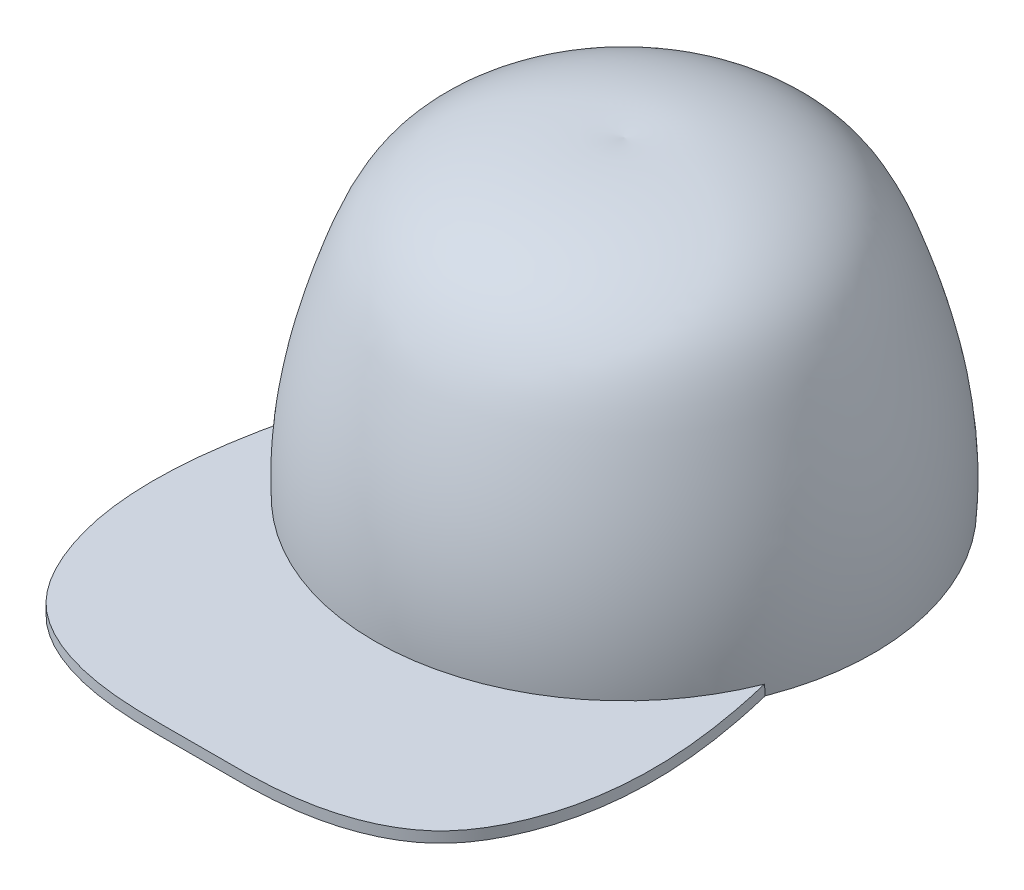
ISO-10303-21;
HEADER;
FILE_DESCRIPTION(('STEP AP214'),'2;1');
FILE_NAME('part.step','',(''),(''),'','','');
FILE_SCHEMA(('AUTOMOTIVE_DESIGN { 1 0 10303 214 1 1 1 1 }'));
ENDSEC;
DATA;
#1=APPLICATION_CONTEXT('core data for automotive mechanical design processes');
#2=APPLICATION_PROTOCOL_DEFINITION('international standard','automotive_design',2000,#1);
#3=PRODUCT_CONTEXT('',#1,'mechanical');
#4=PRODUCT('Part','Part','',(#3));
#5=PRODUCT_RELATED_PRODUCT_CATEGORY('part','',(#4));
#6=PRODUCT_DEFINITION_FORMATION('','',#4);
#7=PRODUCT_DEFINITION_CONTEXT('part definition',#1,'design');
#8=PRODUCT_DEFINITION('design','',#6,#7);
#9=PRODUCT_DEFINITION_SHAPE('','',#8);
#10=(LENGTH_UNIT() NAMED_UNIT(*) SI_UNIT(.MILLI.,.METRE.));
#11=(NAMED_UNIT(*) PLANE_ANGLE_UNIT() SI_UNIT($,.RADIAN.));
#12=(NAMED_UNIT(*) SI_UNIT($,.STERADIAN.) SOLID_ANGLE_UNIT());
#13=UNCERTAINTY_MEASURE_WITH_UNIT(LENGTH_MEASURE(1.E-05),#10,'distance_accuracy_value','');
#14=(GEOMETRIC_REPRESENTATION_CONTEXT(3) GLOBAL_UNCERTAINTY_ASSIGNED_CONTEXT((#13)) GLOBAL_UNIT_ASSIGNED_CONTEXT((#10,
#11,#12)) REPRESENTATION_CONTEXT('',''));
#15=CARTESIAN_POINT('',(0.,0.,0.));
#16=DIRECTION('',(0.,0.,1.));
#17=DIRECTION('',(1.,0.,0.));
#18=AXIS2_PLACEMENT_3D('',#15,#16,#17);
#19=CARTESIAN_POINT('',(-90.,4.18,-130.85));
#20=CARTESIAN_POINT('',(-97.0793096691178,4.18,-101.675750548852));
#21=CARTESIAN_POINT('',(-102.319849387112,4.18,-59.8491014325423));
#22=CARTESIAN_POINT('',(-75.2208808817832,4.18,-11.0048044321176));
#23=CARTESIAN_POINT('',(-38.5303195168428,4.18,1.06979931387679));
#24=CARTESIAN_POINT('',(0.,4.18,-0.48833617963581));
#25=CARTESIAN_POINT('',(38.5303195168428,4.18,1.06979931387678));
#26=CARTESIAN_POINT('',(75.2208808817831,4.18,-11.0048044321176));
#27=CARTESIAN_POINT('',(102.319849387112,4.18,-59.8491014325423));
#28=CARTESIAN_POINT('',(97.0793096691178,4.18,-101.675750548852));
#29=CARTESIAN_POINT('',(90.,4.18,-130.85));
#30=B_SPLINE_CURVE_WITH_KNOTS('',3,(#19,#20,#21,#22,#23,#24,#25,#26,#27,#28,#29),.UNSPECIFIED.,
.F.,.F.,(4,1,1,1,1,1,1,1,4),(0.,0.232377867082386,0.29749861003515,0.407563265498817,0.5,
0.592436734501183,0.70250138996485,0.767622132917614,1.),.UNSPECIFIED.);
#31=DIRECTION('',(0.,-1.,0.));
#32=VECTOR('',#31,1.);
#33=SURFACE_OF_LINEAR_EXTRUSION('',#30,#32);
#34=CARTESIAN_POINT('',(90.0955880969949,4.18,-130.455107886212));
#35=CARTESIAN_POINT('',(90.0835062443815,3.49609904977406,-130.505179936874));
#36=CARTESIAN_POINT('',(90.0694996433252,2.81300235778806,-130.563123638354));
#37=CARTESIAN_POINT('',(90.0376369443269,1.44841749029595,-130.69475434295));
#38=CARTESIAN_POINT('',(90.0197808463849,0.766929314789829,-130.768441346066));
#39=CARTESIAN_POINT('',(90.,0.086245397523655,-130.85));
#40=B_SPLINE_CURVE_WITH_KNOTS('',3,(#34,#35,#36,#37,#38,#39),.UNSPECIFIED.,.F.,.F.,(4,2,4),(0.,
2.05707868885687,4.11415737771374),.UNSPECIFIED.);
#41=CARTESIAN_POINT('',(90.0955880969949,4.18,-130.455107886212));
#42=VERTEX_POINT('',#41);
#43=CARTESIAN_POINT('',(90.,0.0862453975236535,-130.85));
#44=VERTEX_POINT('',#43);
#45=EDGE_CURVE('E87',#42,#44,#40,.T.);
#46=ORIENTED_EDGE('',*,*,#45,.F.);
#47=CARTESIAN_POINT('',(-90.0955880969949,4.18,-130.455107886212));
#48=VERTEX_POINT('',#47);
#49=EDGE_CURVE('E127',#48,#42,#30,.T.);
#50=ORIENTED_EDGE('',*,*,#49,.F.);
#51=CARTESIAN_POINT('',(-90.,0.0862453975234178,-130.85));
#52=CARTESIAN_POINT('',(-90.0197808463849,0.76692931478963,-130.768441346066));
#53=CARTESIAN_POINT('',(-90.0376369443269,1.44841749029578,-130.69475434295));
#54=CARTESIAN_POINT('',(-90.0694996433252,2.81300235778798,-130.563123638354));
#55=CARTESIAN_POINT('',(-90.0835062443815,3.49609904977402,-130.505179936875));
#56=CARTESIAN_POINT('',(-90.0955880969949,4.18000000000001,-130.455107886213));
#57=B_SPLINE_CURVE_WITH_KNOTS('',3,(#51,#52,#53,#54,#55,#56),.UNSPECIFIED.,.F.,.F.,(4,2,4),(0.,
2.05707868885699,4.11415737771398),.UNSPECIFIED.);
#58=CARTESIAN_POINT('',(-90.,0.0862453975234178,-130.85));
#59=VERTEX_POINT('',#58);
#60=EDGE_CURVE('E52',#59,#48,#57,.T.);
#61=ORIENTED_EDGE('',*,*,#60,.F.);
#62=DIRECTION('',(0.,-1.,0.));
#63=VECTOR('',#62,1.);
#64=CARTESIAN_POINT('',(-90.,4.18,-130.85));
#65=LINE('',#64,#63);
#66=CARTESIAN_POINT('',(-90.,0.,-130.85));
#67=VERTEX_POINT('',#66);
#68=EDGE_CURVE('E58',#59,#67,#65,.T.);
#69=ORIENTED_EDGE('',*,*,#68,.T.);
#70=CARTESIAN_POINT('',(-90.,0.,-130.85));
#71=CARTESIAN_POINT('',(-97.0793096691178,0.,-101.675750548852));
#72=CARTESIAN_POINT('',(-102.319849387112,0.,-59.8491014325423));
#73=CARTESIAN_POINT('',(-75.2208808817832,0.,-11.0048044321176));
#74=CARTESIAN_POINT('',(-38.5303195168428,0.,1.06979931387679));
#75=CARTESIAN_POINT('',(0.,0.,-0.48833617963581));
#76=CARTESIAN_POINT('',(38.5303195168428,0.,1.06979931387678));
#77=CARTESIAN_POINT('',(75.2208808817831,0.,-11.0048044321176));
#78=CARTESIAN_POINT('',(102.319849387112,0.,-59.8491014325423));
#79=CARTESIAN_POINT('',(97.0793096691178,0.,-101.675750548852));
#80=CARTESIAN_POINT('',(90.,0.,-130.85));
#81=B_SPLINE_CURVE_WITH_KNOTS('',3,(#70,#71,#72,#73,#74,#75,#76,#77,#78,#79,#80),.UNSPECIFIED.,
.F.,.F.,(4,1,1,1,1,1,1,1,4),(0.,0.232377867082386,0.29749861003515,0.407563265498817,0.5,
0.592436734501183,0.70250138996485,0.767622132917614,1.),.UNSPECIFIED.);
#82=CARTESIAN_POINT('',(90.,0.,-130.85));
#83=VERTEX_POINT('',#82);
#84=EDGE_CURVE('E126',#67,#83,#81,.T.);
#85=ORIENTED_EDGE('',*,*,#84,.T.);
#86=DIRECTION('',(0.,-1.,0.));
#87=VECTOR('',#86,1.);
#88=CARTESIAN_POINT('',(90.,4.18,-130.85));
#89=LINE('',#88,#87);
#90=EDGE_CURVE('E45',#44,#83,#89,.T.);
#91=ORIENTED_EDGE('',*,*,#90,.F.);
#92=EDGE_LOOP('',(#46,#50,#61,#69,#85,#91));
#93=FACE_BOUND('',#92,.T.);
#94=ADVANCED_FACE('F36',(#93),#33,.F.);
#95=CARTESIAN_POINT('',(0.,4.18,-166.176743665723));
#96=DIRECTION('',(0.,-1.,0.));
#97=DIRECTION('',(0.,0.,-1.));
#98=AXIS2_PLACEMENT_3D('',#95,#96,#97);
#99=CYLINDRICAL_SURFACE('',#98,96.6849461810042);
#100=CARTESIAN_POINT('',(90.,0.0862453975234855,-130.85));
#101=CARTESIAN_POINT('',(89.6040755077578,0.0867248526291828,-129.841304869187));
#102=CARTESIAN_POINT('',(89.1911801550303,0.0872011736557143,-128.839271862934));
#103=CARTESIAN_POINT('',(88.332030943499,0.0881469168562876,-126.849850907372));
#104=CARTESIAN_POINT('',(87.8857838544708,0.0886163404073642,-125.862460034484));
#105=CARTESIAN_POINT('',(86.9604000171116,0.0895478058748651,-123.903332949486));
#106=CARTESIAN_POINT('',(86.4812665664646,0.0900098485256991,-122.931595179789));
#107=CARTESIAN_POINT('',(85.4897916038072,0.0909268365689676,-121.003169998976));
#108=CARTESIAN_POINT('',(84.9773961997479,0.0913817688830027,-120.046510299457));
#109=CARTESIAN_POINT('',(83.9206338552704,0.0922832788044682,-118.150879430029));
#110=CARTESIAN_POINT('',(83.376263700706,0.0927298555660172,-117.211910050949));
#111=CARTESIAN_POINT('',(82.2561263445663,0.0936141721595742,-115.352666874058));
#112=CARTESIAN_POINT('',(81.6803527920402,0.0940519101793452,-114.432396910011));
#113=CARTESIAN_POINT('',(80.1029156928423,0.0952074936438153,-112.003125871933));
#114=CARTESIAN_POINT('',(79.0738415675734,0.0959169796929432,-110.511797445324));
#115=CARTESIAN_POINT('',(76.9332831170625,0.0973076399369353,-107.588933594227));
#116=CARTESIAN_POINT('',(75.8217743271395,0.0979888056326251,-106.157416118876));
#117=CARTESIAN_POINT('',(73.5199829215179,0.0993205287872147,-103.358964384178));
#118=CARTESIAN_POINT('',(72.3296942314176,0.0999710838792215,-101.992035118928));
#119=CARTESIAN_POINT('',(69.8734980200897,0.101239804070787,-99.3264668587988));
#120=CARTESIAN_POINT('',(68.6075481706398,0.101857950669662,-98.0278668688158));
#121=CARTESIAN_POINT('',(66.0047491294253,0.103059439964794,-95.5039914284799));
#122=CARTESIAN_POINT('',(64.667905092806,0.103642785185134,-94.2787106603958));
#123=CARTESIAN_POINT('',(61.927436113381,0.104772863193861,-91.9052351892482));
#124=CARTESIAN_POINT('',(60.523812695253,0.105319596817463,-90.7570387276714));
#125=CARTESIAN_POINT('',(58.0133376147478,0.106242674512008,-88.818620952221));
#126=CARTESIAN_POINT('',(56.9200905002619,0.10662742705689,-88.0107060394147));
#127=CARTESIAN_POINT('',(54.7004144168118,0.107374711902045,-86.4416155137621));
#128=CARTESIAN_POINT('',(53.5739833847523,0.107737242816429,-85.6804428160644));
#129=CARTESIAN_POINT('',(51.2901056905137,0.108439373258941,-84.2063153228853));
#130=CARTESIAN_POINT('',(50.1326608859021,0.108778974156191,-83.4933576485422));
#131=CARTESIAN_POINT('',(47.7886333351638,0.109434691219422,-82.1168077471285));
#132=CARTESIAN_POINT('',(46.602047917604,0.109750805221495,-81.453220068636));
#133=CARTESIAN_POINT('',(44.2021663913364,0.110358890733952,-80.1767775612289));
#134=CARTESIAN_POINT('',(42.9888750424769,0.11065086650312,-79.5639137829166));
#135=CARTESIAN_POINT('',(40.5374208304032,0.111210239086476,-78.3898224883094));
#136=CARTESIAN_POINT('',(39.2992556542789,0.111477633601948,-77.8285998012269));
#137=CARTESIAN_POINT('',(36.8004876132319,0.111987306877309,-76.7589055574824));
#138=CARTESIAN_POINT('',(35.5398869511645,0.11222958808721,-76.2504288550045));
#139=CARTESIAN_POINT('',(32.9982524648925,0.112688650075939,-75.2870229112953));
#140=CARTESIAN_POINT('',(31.7172167405175,0.112905428467486,-74.8320986830297));
#141=CARTESIAN_POINT('',(29.137166361052,0.113313058695054,-73.9766820251347));
#142=CARTESIAN_POINT('',(27.8381525615483,0.113503911760233,-73.5761870149357));
#143=CARTESIAN_POINT('',(25.2242738417792,0.113859376517775,-72.8302805062896));
#144=CARTESIAN_POINT('',(23.9094074499596,0.114023985753503,-72.484874164588));
#145=CARTESIAN_POINT('',(21.2664036085338,0.114326630885994,-71.8498338725596));
#146=CARTESIAN_POINT('',(19.9382673991071,0.114464669242047,-71.5601947606511));
#147=CARTESIAN_POINT('',(17.2708404498431,0.114713954641628,-71.0371396660831));
#148=CARTESIAN_POINT('',(15.9315486771033,0.114825199175114,-70.803728950893));
#149=CARTESIAN_POINT('',(13.2444582733986,0.115020669463056,-70.3936026059085));
#150=CARTESIAN_POINT('',(11.8966605631838,0.115104898092456,-70.2168809434473));
#151=CARTESIAN_POINT('',(9.19468484276579,0.115246207745375,-69.920398899976));
#152=CARTESIAN_POINT('',(7.84050623807647,0.115303286186796,-69.8006439367369));
#153=CARTESIAN_POINT('',(5.12844742037095,0.115390176189687,-69.6183428171281));
#154=CARTESIAN_POINT('',(3.77056761330166,0.115419990629604,-69.5557906214728));
#155=CARTESIAN_POINT('',(1.05322107472424,0.115452311121515,-69.4879806199305));
#156=CARTESIAN_POINT('',(-0.30624582205971,0.115454814016837,-69.4827294369041));
#157=CARTESIAN_POINT('',(-3.02420199338591,0.115432498660402,-69.5295481397571));
#158=CARTESIAN_POINT('',(-4.38269126083081,0.115407680212261,-69.5816184376583));
#159=CARTESIAN_POINT('',(-7.09610967243504,0.115330771002224,-69.742978824829));
#160=CARTESIAN_POINT('',(-8.45103920987423,0.11527868339236,-69.8522623008473));
#161=CARTESIAN_POINT('',(-11.155229715075,0.115147324613294,-70.1278654119702));
#162=CARTESIAN_POINT('',(-12.5044900688092,0.115068050572643,-70.2941910719101));
#163=CARTESIAN_POINT('',(-15.1946707108504,0.114882471735456,-70.6835617365451));
#164=CARTESIAN_POINT('',(-16.5355917799285,0.114776169509706,-70.9066013468938));
#165=CARTESIAN_POINT('',(-19.2069621977339,0.114536711047586,-71.4090342095321));
#166=CARTESIAN_POINT('',(-20.5374105715129,0.114403552341046,-71.6884326455217));
#167=CARTESIAN_POINT('',(-23.1852207240125,0.114110640526657,-72.3030447563562));
#168=CARTESIAN_POINT('',(-24.5025837164446,0.113950889910168,-72.6382532024358));
#169=CARTESIAN_POINT('',(-27.1221282826675,0.113605057221695,-73.3639411817397));
#170=CARTESIAN_POINT('',(-28.4243084437712,0.113418972720304,-73.7544258144141));
#171=CARTESIAN_POINT('',(-31.0109268619284,0.113020837027577,-74.5899093634848));
#172=CARTESIAN_POINT('',(-32.2953667672608,0.112808788266935,-75.0349031769025));
#173=CARTESIAN_POINT('',(-34.8443662164508,0.112359088278933,-75.9786505299517));
#174=CARTESIAN_POINT('',(-36.1089254344114,0.112121436632375,-76.477404949811));
#175=CARTESIAN_POINT('',(-38.6157762539423,0.111620984806611,-77.5277315911171));
#176=CARTESIAN_POINT('',(-39.8580699269985,0.111358186981462,-78.079298868493));
#177=CARTESIAN_POINT('',(-42.31842425577,0.110807869648786,-79.2343670623865));
#178=CARTESIAN_POINT('',(-43.5364825058121,0.110520347702002,-79.8378731031334));
#179=CARTESIAN_POINT('',(-45.9459611280108,0.109921149682167,-81.0956400320997));
#180=CARTESIAN_POINT('',(-47.1373839774009,0.10960947586751,-81.7498961747797));
#181=CARTESIAN_POINT('',(-49.4918911469352,0.108962428548319,-83.1082226799364));
#182=CARTESIAN_POINT('',(-50.6549681877401,0.108627049040521,-83.8123056606857));
#183=CARTESIAN_POINT('',(-52.9502935326755,0.107933296568485,-85.2688171507646));
#184=CARTESIAN_POINT('',(-54.0825446633264,0.107574925722575,-86.021241206155));
#185=CARTESIAN_POINT('',(-56.3143854653584,0.106835783207517,-87.573205153587));
#186=CARTESIAN_POINT('',(-57.4139733275696,0.106455010301021,-88.3727476481574));
#187=CARTESIAN_POINT('',(-59.578370406833,0.105671803270818,-90.0174103492867));
#188=CARTESIAN_POINT('',(-60.6431817863011,0.105269370498068,-90.8625277132847));
#189=CARTESIAN_POINT('',(-63.0856249619587,0.104305670178917,-92.8864402504351));
#190=CARTESIAN_POINT('',(-64.4490437480538,0.1037362204765,-94.0824586491836));
#191=CARTESIAN_POINT('',(-67.1064767145754,0.102561825751396,-96.5492579202441));
#192=CARTESIAN_POINT('',(-68.4004889425786,0.101956879731192,-97.8200408935953));
#193=CARTESIAN_POINT('',(-70.9151448463253,0.100713362051511,-100.432479050961));
#194=CARTESIAN_POINT('',(-72.1357817493194,0.100074787298183,-101.774140755874));
#195=CARTESIAN_POINT('',(-74.4987149593726,0.0987666397570553,-104.522852695413));
#196=CARTESIAN_POINT('',(-75.6410747076759,0.0980970928265556,-105.929848389203));
#197=CARTESIAN_POINT('',(-77.8448195605601,0.0967287293176806,-108.805632103311));
#198=CARTESIAN_POINT('',(-78.9062125914407,0.0960299156148004,-110.274414053119));
#199=CARTESIAN_POINT('',(-80.9444808949656,0.0946053901867256,-113.268820705891));
#200=CARTESIAN_POINT('',(-81.9213876927483,0.093879688640087,-114.794423899953));
#201=CARTESIAN_POINT('',(-83.3186033205311,0.0927747160585327,-117.117594797861));
#202=CARTESIAN_POINT('',(-83.7718122367504,0.0924047117059201,-117.89555763354));
#203=CARTESIAN_POINT('',(-84.6562448514406,0.0916589352623864,-119.463693779672));
#204=CARTESIAN_POINT('',(-85.0874732232904,0.0912831644197957,-120.253864447616));
#205=CARTESIAN_POINT('',(-85.927647583948,0.0905261266258107,-121.845848849833));
#206=CARTESIAN_POINT('',(-86.336595938751,0.0901448602634646,-122.647661336321));
#207=CARTESIAN_POINT('',(-87.1312227412247,0.0893777863545588,-124.260924700791));
#208=CARTESIAN_POINT('',(-87.5169421740661,0.0889919883327419,-125.072355387583));
#209=CARTESIAN_POINT('',(-88.2656539264687,0.0882154330413382,-126.705737559157));
#210=CARTESIAN_POINT('',(-88.6286438589825,0.0878246752560436,-127.527690138066));
#211=CARTESIAN_POINT('',(-89.3316486167027,0.0870384630881437,-129.181566916549));
#212=CARTESIAN_POINT('',(-89.6716585841459,0.0866430077331575,-130.013493180984));
#213=CARTESIAN_POINT('',(-90.,0.0862453975236916,-130.85));
#214=B_SPLINE_CURVE_WITH_KNOTS('',3,(#100,#101,#102,#103,#104,#105,#106,#107,#108,#109,#110,
#111,#112,#113,#114,#115,#116,#117,#118,#119,#120,#121,#122,#123,#124,#125,#126,#127,#128,#129,
#130,#131,#132,#133,#134,#135,#136,#137,#138,#139,#140,#141,#142,#143,#144,#145,#146,#147,#148,
#149,#150,#151,#152,#153,#154,#155,#156,#157,#158,#159,#160,#161,#162,#163,#164,#165,#166,#167,
#168,#169,#170,#171,#172,#173,#174,#175,#176,#177,#178,#179,#180,#181,#182,#183,#184,#185,#186,
#187,#188,#189,#190,#191,#192,#193,#194,#195,#196,#197,#198,#199,#200,#201,#202,#203,#204,#205,
#206,#207,#208,#209,#210,#211,#212,#213),.UNSPECIFIED.,.F.,.F.,(4,2,2,2,2,2,2,2,2,2,2,2,2,2,2,2,
2,2,2,2,2,2,2,2,2,2,2,2,2,2,2,2,2,2,2,2,2,2,2,2,2,2,2,2,2,2,2,2,2,2,2,2,2,2,2,2,4),(0.,
3.25069178492018,6.50072552322068,9.75043383876495,13.0055456091913,16.2609851498065,
19.5170855220162,24.9497767393864,30.3840867544279,35.8188162765442,41.2566152173733,
46.6940192837064,52.131299265132,56.2083064103158,60.2855675665029,64.3625850589426,
68.4399777129777,72.5166494377713,76.5937020055675,80.6703564476662,84.7473921962383,
88.8242345790389,92.9014583636034,96.9783045957771,101.05553259802,105.132326570702,
109.209508186031,113.286259295833,117.363481592224,121.44073319553,125.517513614776,
129.594724759093,133.671548244497,137.748746873858,141.825563730641,145.902756935551,
149.979568737716,154.056447300071,158.132944578252,162.209844501877,166.286363661336,
170.363918888605,174.441098964688,178.518504450222,182.595655916423,188.033643591787,
193.471784158911,198.910425913423,204.344606363623,209.778254145981,215.209865593041,
217.910620049018,220.610797869955,223.310688388113,226.005666525979,228.700927216847,
231.396755891591),.UNSPECIFIED.);
#215=EDGE_CURVE('E122',#44,#59,#214,.T.);
#216=ORIENTED_EDGE('',*,*,#215,.F.);
#217=ORIENTED_EDGE('',*,*,#90,.T.);
#218=CARTESIAN_POINT('',(0.,0.,-166.176743665723));
#219=DIRECTION('',(0.,-1.,0.));
#220=DIRECTION('',(0.,0.,-1.));
#221=AXIS2_PLACEMENT_3D('',#218,#219,#220);
#222=CIRCLE('',#221,96.6849461810042);
#223=EDGE_CURVE('E156',#83,#67,#222,.T.);
#224=ORIENTED_EDGE('',*,*,#223,.T.);
#225=ORIENTED_EDGE('',*,*,#68,.F.);
#226=EDGE_LOOP('',(#216,#217,#224,#225));
#227=FACE_BOUND('',#226,.T.);
#228=ADVANCED_FACE('F132',(#227),#99,.F.);
#229=CARTESIAN_POINT('',(0.,4.18,0.));
#230=DIRECTION('',(0.,1.,0.));
#231=DIRECTION('',(0.,0.,1.));
#232=AXIS2_PLACEMENT_3D('',#229,#230,#231);
#233=PLANE('',#232);
#234=ORIENTED_EDGE('',*,*,#49,.T.);
#235=CARTESIAN_POINT('',(0.,4.18,-166.18));
#236=DIRECTION('',(0.,1.,0.));
#237=DIRECTION('',(0.,0.,1.));
#238=AXIS2_PLACEMENT_3D('',#235,#236,#237);
#239=CIRCLE('',#238,96.9199820010566);
#240=EDGE_CURVE('E11',#42,#48,#239,.F.);
#241=ORIENTED_EDGE('',*,*,#240,.T.);
#242=EDGE_LOOP('',(#234,#241));
#243=FACE_BOUND('',#242,.T.);
#244=ADVANCED_FACE('F136',(#243),#233,.T.);
#245=CARTESIAN_POINT('',(0.,0.,0.));
#246=DIRECTION('',(0.,1.,0.));
#247=DIRECTION('',(0.,0.,1.));
#248=AXIS2_PLACEMENT_3D('',#245,#246,#247);
#249=PLANE('',#248);
#250=ORIENTED_EDGE('',*,*,#84,.F.);
#251=ORIENTED_EDGE('',*,*,#223,.F.);
#252=EDGE_LOOP('',(#250,#251));
#253=FACE_BOUND('',#252,.T.);
#254=ADVANCED_FACE('F104',(#253),#249,.F.);
#255=CARTESIAN_POINT('',(0.,0.,-69.5));
#256=CARTESIAN_POINT('',(0.,26.8507286625503,-67.5818832957356));
#257=CARTESIAN_POINT('',(0.,61.0707329058673,-75.0890303257683));
#258=CARTESIAN_POINT('',(0.,120.341869464771,-98.2637868329793));
#259=CARTESIAN_POINT('',(0.,127.741871183885,-143.49840082785));
#260=CARTESIAN_POINT('',(0.,125.,-166.18));
#261=B_SPLINE_CURVE_WITH_KNOTS('',3,(#255,#256,#257,#258,#259,#260),.UNSPECIFIED.,.F.,.F.,(4,1,
1,4),(0.,0.425686614776061,0.582159448388124,1.),.UNSPECIFIED.);
#262=CARTESIAN_POINT('',(0.,125.,-166.18));
#263=DIRECTION('',(0.,1.,0.));
#264=AXIS1_PLACEMENT('',#262,#263);
#265=SURFACE_OF_REVOLUTION('',#261,#264);
#266=CARTESIAN_POINT('',(0.,0.,-166.18));
#267=DIRECTION('',(0.,1.,0.));
#268=DIRECTION('',(0.,0.,1.));
#269=AXIS2_PLACEMENT_3D('',#266,#267,#268);
#270=CIRCLE('',#269,96.68);
#271=CARTESIAN_POINT('',(0.,0.,-69.5));
#272=VERTEX_POINT('',#271);
#273=EDGE_CURVE('E85',#272,#272,#270,.T.);
#274=ORIENTED_EDGE('',*,*,#273,.T.);
#275=EDGE_LOOP('',(#274));
#276=FACE_BOUND('',#275,.T.);
#277=CARTESIAN_POINT('',(0.,125.,-166.18));
#278=VERTEX_POINT('',#277);
#279=VERTEX_LOOP('',#278);
#280=FACE_BOUND('',#279,.T.);
#281=ORIENTED_EDGE('',*,*,#45,.T.);
#282=ORIENTED_EDGE('',*,*,#215,.T.);
#283=ORIENTED_EDGE('',*,*,#60,.T.);
#284=ORIENTED_EDGE('',*,*,#240,.F.);
#285=EDGE_LOOP('',(#281,#282,#283,#284));
#286=FACE_BOUND('',#285,.T.);
#287=ADVANCED_FACE('F101',(#276,#280,#286),#265,.T.);
#288=CARTESIAN_POINT('',(0.,0.,0.));
#289=DIRECTION('',(0.,1.,0.));
#290=DIRECTION('',(0.,0.,1.));
#291=AXIS2_PLACEMENT_3D('',#288,#289,#290);
#292=PLANE('',#291);
#293=ORIENTED_EDGE('',*,*,#273,.F.);
#294=EDGE_LOOP('',(#293));
#295=FACE_BOUND('',#294,.T.);
#296=CARTESIAN_POINT('',(0.,0.,-166.18));
#297=DIRECTION('',(0.,1.,0.));
#298=DIRECTION('',(0.,0.,1.));
#299=AXIS2_PLACEMENT_3D('',#296,#297,#298);
#300=CIRCLE('',#299,94.68);
#301=CARTESIAN_POINT('',(0.,0.,-71.5));
#302=VERTEX_POINT('',#301);
#303=EDGE_CURVE('E83',#302,#302,#300,.T.);
#304=ORIENTED_EDGE('',*,*,#303,.T.);
#305=EDGE_LOOP('',(#304));
#306=FACE_BOUND('',#305,.T.);
#307=ADVANCED_FACE('F79',(#295,#306),#292,.F.);
#308=CARTESIAN_POINT('',(0.,0.,-71.5));
#309=CARTESIAN_POINT('',(0.,26.9773144410315,-69.486543186069));
#310=CARTESIAN_POINT('',(0.,60.8484036136005,-77.2564811986952));
#311=CARTESIAN_POINT('',(0.,119.860936937981,-99.6163333524843));
#312=CARTESIAN_POINT('',(0.,124.958895380483,-144.968117818647));
#313=CARTESIAN_POINT('',(0.,123.,-166.18));
#314=B_SPLINE_CURVE_WITH_KNOTS('',3,(#308,#309,#310,#311,#312,#313),.UNSPECIFIED.,.F.,.F.,(4,1,
1,4),(0.,0.432120240342582,0.59095793013722,1.),.UNSPECIFIED.);
#315=CARTESIAN_POINT('',(0.,125.,-166.18));
#316=DIRECTION('',(0.,1.,0.));
#317=AXIS1_PLACEMENT('',#315,#316);
#318=SURFACE_OF_REVOLUTION('',#314,#317);
#319=CARTESIAN_POINT('',(0.,123.,-166.18));
#320=VERTEX_POINT('',#319);
#321=VERTEX_LOOP('',#320);
#322=FACE_BOUND('',#321,.T.);
#323=ORIENTED_EDGE('',*,*,#303,.F.);
#324=EDGE_LOOP('',(#323));
#325=FACE_BOUND('',#324,.T.);
#326=ADVANCED_FACE('F76',(#322,#325),#318,.F.);
#327=CLOSED_SHELL('',(#94,#228,#244,#254,#287,#307,#326));
#328=MANIFOLD_SOLID_BREP('B2',#327);
#329=ADVANCED_BREP_SHAPE_REPRESENTATION('',(#18,#328),#14);
#330=SHAPE_DEFINITION_REPRESENTATION(#9,#329);
ENDSEC;
END-ISO-10303-21;
